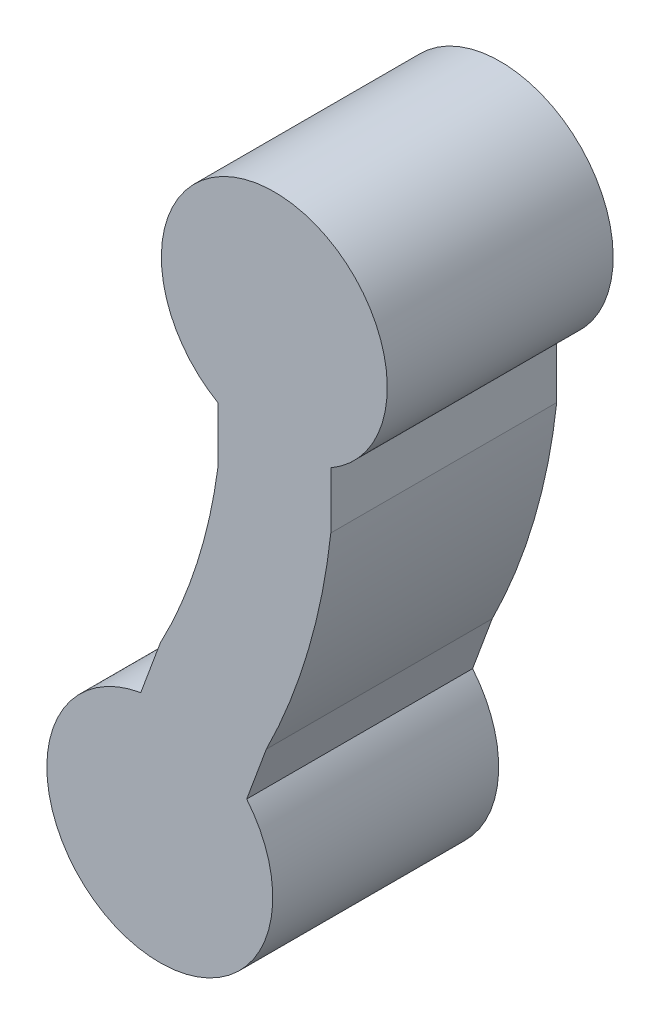
ISO-10303-21;
HEADER;
FILE_DESCRIPTION(('STEP AP214'),'2;1');
FILE_NAME('part.step','',(''),(''),'','','');
FILE_SCHEMA(('AUTOMOTIVE_DESIGN { 1 0 10303 214 1 1 1 1 }'));
ENDSEC;
DATA;
#1=APPLICATION_CONTEXT('core data for automotive mechanical design processes');
#2=APPLICATION_PROTOCOL_DEFINITION('international standard','automotive_design',2000,#1);
#3=PRODUCT_CONTEXT('',#1,'mechanical');
#4=PRODUCT('Part','Part','',(#3));
#5=PRODUCT_RELATED_PRODUCT_CATEGORY('part','',(#4));
#6=PRODUCT_DEFINITION_FORMATION('','',#4);
#7=PRODUCT_DEFINITION_CONTEXT('part definition',#1,'design');
#8=PRODUCT_DEFINITION('design','',#6,#7);
#9=PRODUCT_DEFINITION_SHAPE('','',#8);
#10=(LENGTH_UNIT() NAMED_UNIT(*) SI_UNIT(.MILLI.,.METRE.));
#11=(NAMED_UNIT(*) PLANE_ANGLE_UNIT() SI_UNIT($,.RADIAN.));
#12=(NAMED_UNIT(*) SI_UNIT($,.STERADIAN.) SOLID_ANGLE_UNIT());
#13=UNCERTAINTY_MEASURE_WITH_UNIT(LENGTH_MEASURE(1.E-05),#10,'distance_accuracy_value','');
#14=(GEOMETRIC_REPRESENTATION_CONTEXT(3) GLOBAL_UNCERTAINTY_ASSIGNED_CONTEXT((#13)) GLOBAL_UNIT_ASSIGNED_CONTEXT((#10,
#11,#12)) REPRESENTATION_CONTEXT('',''));
#15=CARTESIAN_POINT('',(0.,0.,0.));
#16=DIRECTION('',(0.,0.,1.));
#17=DIRECTION('',(1.,0.,0.));
#18=AXIS2_PLACEMENT_3D('',#15,#16,#17);
#19=CARTESIAN_POINT('',(0.,0.,-2.));
#20=DIRECTION('',(0.,0.,1.));
#21=DIRECTION('',(1.,0.,0.));
#22=AXIS2_PLACEMENT_3D('',#19,#20,#21);
#23=CYLINDRICAL_SURFACE('',#22,1.);
#24=CARTESIAN_POINT('',(0.,0.,0.));
#25=DIRECTION('',(0.,0.,1.));
#26=DIRECTION('',(1.,0.,0.));
#27=AXIS2_PLACEMENT_3D('',#24,#25,#26);
#28=CIRCLE('',#27,1.);
#29=CARTESIAN_POINT('',(0.500000000000005,-0.866025403784439,0.));
#30=VERTEX_POINT('',#29);
#31=CARTESIAN_POINT('',(-0.5,-0.866025403784439,0.));
#32=VERTEX_POINT('',#31);
#33=EDGE_CURVE('E133',#30,#32,#28,.T.);
#34=ORIENTED_EDGE('',*,*,#33,.F.);
#35=DIRECTION('',(0.,0.,1.));
#36=VECTOR('',#35,1.);
#37=CARTESIAN_POINT('',(0.500000000000005,-0.866025403784439,-2.));
#38=LINE('',#37,#36);
#39=CARTESIAN_POINT('',(0.500000000000005,-0.866025403784439,-2.));
#40=VERTEX_POINT('',#39);
#41=EDGE_CURVE('E11',#40,#30,#38,.T.);
#42=ORIENTED_EDGE('',*,*,#41,.F.);
#43=CARTESIAN_POINT('',(0.,0.,-2.));
#44=DIRECTION('',(0.,0.,1.));
#45=DIRECTION('',(1.,0.,0.));
#46=AXIS2_PLACEMENT_3D('',#43,#44,#45);
#47=CIRCLE('',#46,1.);
#48=CARTESIAN_POINT('',(-0.5,-0.866025403784439,-2.));
#49=VERTEX_POINT('',#48);
#50=EDGE_CURVE('E153',#40,#49,#47,.T.);
#51=ORIENTED_EDGE('',*,*,#50,.T.);
#52=DIRECTION('',(0.,0.,1.));
#53=VECTOR('',#52,1.);
#54=CARTESIAN_POINT('',(-0.5,-0.866025403784439,-2.));
#55=LINE('',#54,#53);
#56=EDGE_CURVE('E39',#49,#32,#55,.T.);
#57=ORIENTED_EDGE('',*,*,#56,.T.);
#58=EDGE_LOOP('',(#34,#42,#51,#57));
#59=FACE_BOUND('',#58,.T.);
#60=ADVANCED_FACE('F36',(#59),#23,.T.);
#61=CARTESIAN_POINT('',(0.500000000000009,-1.36602540378444,-2.));
#62=DIRECTION('',(1.,0.,0.));
#63=DIRECTION('',(0.,1.,0.));
#64=AXIS2_PLACEMENT_3D('',#61,#62,#63);
#65=PLANE('',#64);
#66=DIRECTION('',(0.,1.,0.));
#67=VECTOR('',#66,1.);
#68=CARTESIAN_POINT('',(0.500000000000009,-1.36602540378444,0.));
#69=LINE('',#68,#67);
#70=CARTESIAN_POINT('',(0.500000000000009,-1.36602540378444,0.));
#71=VERTEX_POINT('',#70);
#72=EDGE_CURVE('E151',#71,#30,#69,.T.);
#73=ORIENTED_EDGE('',*,*,#72,.F.);
#74=DIRECTION('',(0.,0.,1.));
#75=VECTOR('',#74,1.);
#76=CARTESIAN_POINT('',(0.500000000000009,-1.36602540378444,-2.));
#77=LINE('',#76,#75);
#78=CARTESIAN_POINT('',(0.500000000000009,-1.36602540378444,-2.));
#79=VERTEX_POINT('',#78);
#80=EDGE_CURVE('E45',#79,#71,#77,.T.);
#81=ORIENTED_EDGE('',*,*,#80,.F.);
#82=DIRECTION('',(0.,1.,0.));
#83=VECTOR('',#82,1.);
#84=CARTESIAN_POINT('',(0.500000000000009,-1.36602540378444,-2.));
#85=LINE('',#84,#83);
#86=EDGE_CURVE('E123',#79,#40,#85,.T.);
#87=ORIENTED_EDGE('',*,*,#86,.T.);
#88=ORIENTED_EDGE('',*,*,#41,.T.);
#89=EDGE_LOOP('',(#73,#81,#87,#88));
#90=FACE_BOUND('',#89,.T.);
#91=ADVANCED_FACE('F165',(#90),#65,.T.);
#92=CARTESIAN_POINT('',(-5.21295624590589,-0.742594268742238,-2.));
#93=DIRECTION('',(0.,0.,1.));
#94=DIRECTION('',(1.,0.,0.));
#95=AXIS2_PLACEMENT_3D('',#92,#93,#94);
#96=CYLINDRICAL_SURFACE('',#95,5.74687179670603);
#97=CARTESIAN_POINT('',(-5.21295624590589,-0.742594268742238,0.));
#98=DIRECTION('',(0.,0.,1.));
#99=DIRECTION('',(1.,0.,0.));
#100=AXIS2_PLACEMENT_3D('',#97,#98,#99);
#101=CIRCLE('',#100,5.74687179670603);
#102=CARTESIAN_POINT('',(-0.0710611383649713,-3.30919711118241,0.));
#103=VERTEX_POINT('',#102);
#104=EDGE_CURVE('E110',#103,#71,#101,.T.);
#105=ORIENTED_EDGE('',*,*,#104,.F.);
#106=DIRECTION('',(0.,0.,1.));
#107=VECTOR('',#106,1.);
#108=CARTESIAN_POINT('',(-0.0710611383649713,-3.30919711118241,-2.));
#109=LINE('',#108,#107);
#110=CARTESIAN_POINT('',(-0.0710611383649713,-3.30919711118241,-2.));
#111=VERTEX_POINT('',#110);
#112=EDGE_CURVE('E105',#111,#103,#109,.T.);
#113=ORIENTED_EDGE('',*,*,#112,.F.);
#114=CARTESIAN_POINT('',(-5.21295624590589,-0.742594268742238,-2.));
#115=DIRECTION('',(0.,0.,1.));
#116=DIRECTION('',(1.,0.,0.));
#117=AXIS2_PLACEMENT_3D('',#114,#115,#116);
#118=CIRCLE('',#117,5.74687179670603);
#119=EDGE_CURVE('E108',#111,#79,#118,.T.);
#120=ORIENTED_EDGE('',*,*,#119,.T.);
#121=ORIENTED_EDGE('',*,*,#80,.T.);
#122=EDGE_LOOP('',(#105,#113,#120,#121));
#123=FACE_BOUND('',#122,.T.);
#124=ADVANCED_FACE('F107',(#123),#96,.T.);
#125=CARTESIAN_POINT('',(-0.244516695858111,-3.77814611648549,-2.));
#126=DIRECTION('',(0.937898010606151,-0.346911114986281,0.));
#127=DIRECTION('',(0.346911114986281,0.937898010606151,0.));
#128=AXIS2_PLACEMENT_3D('',#125,#126,#127);
#129=PLANE('',#128);
#130=DIRECTION('',(0.346911114986281,0.937898010606151,0.));
#131=VECTOR('',#130,1.);
#132=CARTESIAN_POINT('',(-0.244516695858111,-3.77814611648549,0.));
#133=LINE('',#132,#131);
#134=CARTESIAN_POINT('',(-0.244516695858111,-3.77814611648549,0.));
#135=VERTEX_POINT('',#134);
#136=EDGE_CURVE('E148',#135,#103,#133,.T.);
#137=ORIENTED_EDGE('',*,*,#136,.F.);
#138=DIRECTION('',(0.,0.,1.));
#139=VECTOR('',#138,1.);
#140=CARTESIAN_POINT('',(-0.244516695858111,-3.77814611648549,-2.));
#141=LINE('',#140,#139);
#142=CARTESIAN_POINT('',(-0.244516695858111,-3.77814611648549,-2.));
#143=VERTEX_POINT('',#142);
#144=EDGE_CURVE('E115',#143,#135,#141,.T.);
#145=ORIENTED_EDGE('',*,*,#144,.F.);
#146=DIRECTION('',(0.346911114986281,0.937898010606151,0.));
#147=VECTOR('',#146,1.);
#148=CARTESIAN_POINT('',(-0.244516695858111,-3.77814611648549,-2.));
#149=LINE('',#148,#147);
#150=EDGE_CURVE('E121',#143,#111,#149,.T.);
#151=ORIENTED_EDGE('',*,*,#150,.T.);
#152=ORIENTED_EDGE('',*,*,#112,.T.);
#153=EDGE_LOOP('',(#137,#145,#151,#152));
#154=FACE_BOUND('',#153,.T.);
#155=ADVANCED_FACE('F125',(#154),#129,.T.);
#156=CARTESIAN_POINT('',(-1.01389953959449,-4.41693406233617,-2.));
#157=DIRECTION('',(0.,0.,1.));
#158=DIRECTION('',(1.,0.,0.));
#159=AXIS2_PLACEMENT_3D('',#156,#157,#158);
#160=CYLINDRICAL_SURFACE('',#159,1.);
#161=CARTESIAN_POINT('',(-1.01389953959449,-4.41693406233617,0.));
#162=DIRECTION('',(0.,0.,1.));
#163=DIRECTION('',(1.,0.,0.));
#164=AXIS2_PLACEMENT_3D('',#161,#162,#163);
#165=CIRCLE('',#164,1.);
#166=CARTESIAN_POINT('',(-1.18241470646426,-3.43123500149921,0.));
#167=VERTEX_POINT('',#166);
#168=EDGE_CURVE('E145',#167,#135,#165,.T.);
#169=ORIENTED_EDGE('',*,*,#168,.F.);
#170=DIRECTION('',(0.,0.,1.));
#171=VECTOR('',#170,1.);
#172=CARTESIAN_POINT('',(-1.18241470646426,-3.43123500149921,-2.));
#173=LINE('',#172,#171);
#174=CARTESIAN_POINT('',(-1.18241470646426,-3.43123500149921,-2.));
#175=VERTEX_POINT('',#174);
#176=EDGE_CURVE('E157',#175,#167,#173,.T.);
#177=ORIENTED_EDGE('',*,*,#176,.F.);
#178=CARTESIAN_POINT('',(-1.01389953959449,-4.41693406233617,-2.));
#179=DIRECTION('',(0.,0.,1.));
#180=DIRECTION('',(1.,0.,0.));
#181=AXIS2_PLACEMENT_3D('',#178,#179,#180);
#182=CIRCLE('',#181,1.);
#183=EDGE_CURVE('E126',#175,#143,#182,.T.);
#184=ORIENTED_EDGE('',*,*,#183,.T.);
#185=ORIENTED_EDGE('',*,*,#144,.T.);
#186=EDGE_LOOP('',(#169,#177,#184,#185));
#187=FACE_BOUND('',#186,.T.);
#188=ADVANCED_FACE('F178',(#187),#160,.T.);
#189=CARTESIAN_POINT('',(-1.18241470646426,-3.43123500149921,-2.));
#190=DIRECTION('',(-0.937898010606151,0.346911114986281,0.));
#191=DIRECTION('',(-0.346911114986281,-0.937898010606151,0.));
#192=AXIS2_PLACEMENT_3D('',#189,#190,#191);
#193=PLANE('',#192);
#194=DIRECTION('',(-0.346911114986281,-0.937898010606151,0.));
#195=VECTOR('',#194,1.);
#196=CARTESIAN_POINT('',(-1.18241470646426,-3.43123500149921,0.));
#197=LINE('',#196,#195);
#198=CARTESIAN_POINT('',(-1.00895914897112,-2.96228599619614,0.));
#199=VERTEX_POINT('',#198);
#200=EDGE_CURVE('E142',#199,#167,#197,.T.);
#201=ORIENTED_EDGE('',*,*,#200,.F.);
#202=DIRECTION('',(0.,0.,1.));
#203=VECTOR('',#202,1.);
#204=CARTESIAN_POINT('',(-1.00895914897112,-2.96228599619614,-2.));
#205=LINE('',#204,#203);
#206=CARTESIAN_POINT('',(-1.00895914897112,-2.96228599619614,-2.));
#207=VERTEX_POINT('',#206);
#208=EDGE_CURVE('E159',#207,#199,#205,.T.);
#209=ORIENTED_EDGE('',*,*,#208,.F.);
#210=DIRECTION('',(-0.346911114986281,-0.937898010606151,0.));
#211=VECTOR('',#210,1.);
#212=CARTESIAN_POINT('',(-1.18241470646426,-3.43123500149921,-2.));
#213=LINE('',#212,#211);
#214=EDGE_CURVE('E128',#207,#175,#213,.T.);
#215=ORIENTED_EDGE('',*,*,#214,.T.);
#216=ORIENTED_EDGE('',*,*,#176,.T.);
#217=EDGE_LOOP('',(#201,#209,#215,#216));
#218=FACE_BOUND('',#217,.T.);
#219=ADVANCED_FACE('F181',(#218),#193,.T.);
#220=CARTESIAN_POINT('',(-5.21295624590362,-0.74259426874293,-2.));
#221=DIRECTION('',(0.,0.,1.));
#222=DIRECTION('',(1.,0.,0.));
#223=AXIS2_PLACEMENT_3D('',#220,#221,#222);
#224=CYLINDRICAL_SURFACE('',#223,4.75401124903392);
#225=CARTESIAN_POINT('',(-5.21295624590362,-0.74259426874293,0.));
#226=DIRECTION('',(0.,0.,-1.));
#227=DIRECTION('',(1.,0.,0.));
#228=AXIS2_PLACEMENT_3D('',#225,#226,#227);
#229=CIRCLE('',#228,4.75401124903392);
#230=CARTESIAN_POINT('',(-0.5,-1.36602540378444,0.));
#231=VERTEX_POINT('',#230);
#232=EDGE_CURVE('E139',#231,#199,#229,.T.);
#233=ORIENTED_EDGE('',*,*,#232,.F.);
#234=DIRECTION('',(0.,0.,1.));
#235=VECTOR('',#234,1.);
#236=CARTESIAN_POINT('',(-0.5,-1.36602540378444,-2.));
#237=LINE('',#236,#235);
#238=CARTESIAN_POINT('',(-0.5,-1.36602540378444,-2.));
#239=VERTEX_POINT('',#238);
#240=EDGE_CURVE('E160',#239,#231,#237,.T.);
#241=ORIENTED_EDGE('',*,*,#240,.F.);
#242=CARTESIAN_POINT('',(-5.21295624590362,-0.74259426874293,-2.));
#243=DIRECTION('',(0.,0.,-1.));
#244=DIRECTION('',(1.,0.,0.));
#245=AXIS2_PLACEMENT_3D('',#242,#243,#244);
#246=CIRCLE('',#245,4.75401124903392);
#247=EDGE_CURVE('E276',#239,#207,#246,.T.);
#248=ORIENTED_EDGE('',*,*,#247,.T.);
#249=ORIENTED_EDGE('',*,*,#208,.T.);
#250=EDGE_LOOP('',(#233,#241,#248,#249));
#251=FACE_BOUND('',#250,.T.);
#252=ADVANCED_FACE('F185',(#251),#224,.F.);
#253=CARTESIAN_POINT('',(-0.500000000000001,-1.36602540378444,-2.));
#254=DIRECTION('',(-1.,0.,0.));
#255=DIRECTION('',(0.,-1.,0.));
#256=AXIS2_PLACEMENT_3D('',#253,#254,#255);
#257=PLANE('',#256);
#258=DIRECTION('',(0.,-1.,0.));
#259=VECTOR('',#258,1.);
#260=CARTESIAN_POINT('',(-0.500000000000001,-1.36602540378444,0.));
#261=LINE('',#260,#259);
#262=EDGE_CURVE('E136',#32,#231,#261,.T.);
#263=ORIENTED_EDGE('',*,*,#262,.F.);
#264=ORIENTED_EDGE('',*,*,#56,.F.);
#265=DIRECTION('',(0.,-1.,0.));
#266=VECTOR('',#265,1.);
#267=CARTESIAN_POINT('',(-0.500000000000001,-1.36602540378444,-2.));
#268=LINE('',#267,#266);
#269=EDGE_CURVE('E277',#49,#239,#268,.T.);
#270=ORIENTED_EDGE('',*,*,#269,.T.);
#271=ORIENTED_EDGE('',*,*,#240,.T.);
#272=EDGE_LOOP('',(#263,#264,#270,#271));
#273=FACE_BOUND('',#272,.T.);
#274=ADVANCED_FACE('F162',(#273),#257,.T.);
#275=CARTESIAN_POINT('',(0.,0.,-2.));
#276=DIRECTION('',(0.,0.,1.));
#277=DIRECTION('',(1.,0.,0.));
#278=AXIS2_PLACEMENT_3D('',#275,#276,#277);
#279=PLANE('',#278);
#280=ORIENTED_EDGE('',*,*,#50,.F.);
#281=ORIENTED_EDGE('',*,*,#86,.F.);
#282=ORIENTED_EDGE('',*,*,#119,.F.);
#283=ORIENTED_EDGE('',*,*,#150,.F.);
#284=ORIENTED_EDGE('',*,*,#183,.F.);
#285=ORIENTED_EDGE('',*,*,#214,.F.);
#286=ORIENTED_EDGE('',*,*,#247,.F.);
#287=ORIENTED_EDGE('',*,*,#269,.F.);
#288=EDGE_LOOP('',(#280,#281,#282,#283,#284,#285,#286,#287));
#289=FACE_BOUND('',#288,.T.);
#290=ADVANCED_FACE('F119',(#289),#279,.F.);
#291=CARTESIAN_POINT('',(0.,0.,0.));
#292=DIRECTION('',(0.,0.,1.));
#293=DIRECTION('',(1.,0.,0.));
#294=AXIS2_PLACEMENT_3D('',#291,#292,#293);
#295=PLANE('',#294);
#296=ORIENTED_EDGE('',*,*,#33,.T.);
#297=ORIENTED_EDGE('',*,*,#262,.T.);
#298=ORIENTED_EDGE('',*,*,#232,.T.);
#299=ORIENTED_EDGE('',*,*,#200,.T.);
#300=ORIENTED_EDGE('',*,*,#168,.T.);
#301=ORIENTED_EDGE('',*,*,#136,.T.);
#302=ORIENTED_EDGE('',*,*,#104,.T.);
#303=ORIENTED_EDGE('',*,*,#72,.T.);
#304=EDGE_LOOP('',(#296,#297,#298,#299,#300,#301,#302,#303));
#305=FACE_BOUND('',#304,.T.);
#306=ADVANCED_FACE('F164',(#305),#295,.T.);
#307=CLOSED_SHELL('',(#60,#91,#124,#155,#188,#219,#252,#274,#290,#306));
#308=MANIFOLD_SOLID_BREP('B2',#307);
#309=ADVANCED_BREP_SHAPE_REPRESENTATION('',(#18,#308),#14);
#310=SHAPE_DEFINITION_REPRESENTATION(#9,#309);
ENDSEC;
END-ISO-10303-21;
